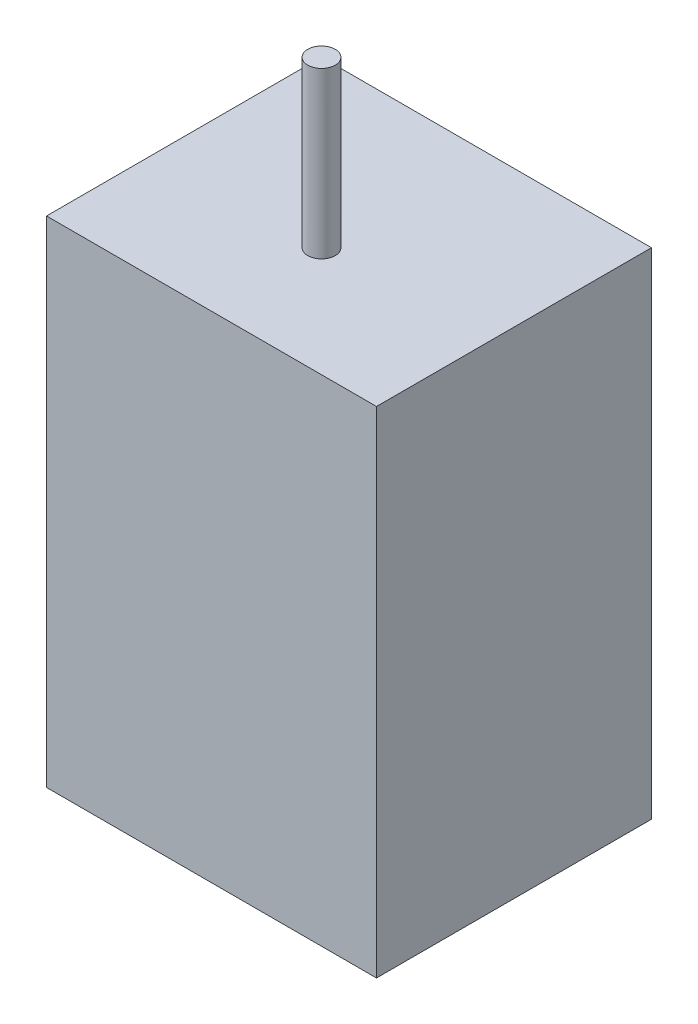
ISO-10303-21;
HEADER;
FILE_DESCRIPTION(('STEP AP214'),'2;1');
FILE_NAME('part.step','',(''),(''),'','','');
FILE_SCHEMA(('AUTOMOTIVE_DESIGN { 1 0 10303 214 1 1 1 1 }'));
ENDSEC;
DATA;
#1=APPLICATION_CONTEXT('core data for automotive mechanical design processes');
#2=APPLICATION_PROTOCOL_DEFINITION('international standard','automotive_design',2000,#1);
#3=PRODUCT_CONTEXT('',#1,'mechanical');
#4=PRODUCT('Part','Part','',(#3));
#5=PRODUCT_RELATED_PRODUCT_CATEGORY('part','',(#4));
#6=PRODUCT_DEFINITION_FORMATION('','',#4);
#7=PRODUCT_DEFINITION_CONTEXT('part definition',#1,'design');
#8=PRODUCT_DEFINITION('design','',#6,#7);
#9=PRODUCT_DEFINITION_SHAPE('','',#8);
#10=(LENGTH_UNIT() NAMED_UNIT(*) SI_UNIT(.MILLI.,.METRE.));
#11=(NAMED_UNIT(*) PLANE_ANGLE_UNIT() SI_UNIT($,.RADIAN.));
#12=(NAMED_UNIT(*) SI_UNIT($,.STERADIAN.) SOLID_ANGLE_UNIT());
#13=UNCERTAINTY_MEASURE_WITH_UNIT(LENGTH_MEASURE(1.E-05),#10,'distance_accuracy_value','');
#14=(GEOMETRIC_REPRESENTATION_CONTEXT(3) GLOBAL_UNCERTAINTY_ASSIGNED_CONTEXT((#13)) GLOBAL_UNIT_ASSIGNED_CONTEXT((#10,
#11,#12)) REPRESENTATION_CONTEXT('',''));
#15=CARTESIAN_POINT('',(0.,0.,0.));
#16=DIRECTION('',(0.,0.,1.));
#17=DIRECTION('',(1.,0.,0.));
#18=AXIS2_PLACEMENT_3D('',#15,#16,#17);
#19=CARTESIAN_POINT('',(0.,28.575,0.));
#20=DIRECTION('',(1.,0.,0.));
#21=DIRECTION('',(0.,0.,-1.));
#22=AXIS2_PLACEMENT_3D('',#19,#20,#21);
#23=PLANE('',#22);
#24=DIRECTION('',(0.,0.,1.));
#25=VECTOR('',#24,1.);
#26=CARTESIAN_POINT('',(0.,0.,0.));
#27=LINE('',#26,#25);
#28=CARTESIAN_POINT('',(0.,0.,-15.875));
#29=VERTEX_POINT('',#28);
#30=CARTESIAN_POINT('',(0.,0.,0.));
#31=VERTEX_POINT('',#30);
#32=EDGE_CURVE('E101',#29,#31,#27,.T.);
#33=ORIENTED_EDGE('',*,*,#32,.T.);
#34=DIRECTION('',(0.,-1.,0.));
#35=VECTOR('',#34,1.);
#36=CARTESIAN_POINT('',(0.,28.575,0.));
#37=LINE('',#36,#35);
#38=CARTESIAN_POINT('',(0.,28.575,0.));
#39=VERTEX_POINT('',#38);
#40=EDGE_CURVE('E43',#39,#31,#37,.T.);
#41=ORIENTED_EDGE('',*,*,#40,.F.);
#42=DIRECTION('',(0.,0.,1.));
#43=VECTOR('',#42,1.);
#44=CARTESIAN_POINT('',(0.,28.575,0.));
#45=LINE('',#44,#43);
#46=CARTESIAN_POINT('',(0.,28.575,-15.875));
#47=VERTEX_POINT('',#46);
#48=EDGE_CURVE('E87',#47,#39,#45,.T.);
#49=ORIENTED_EDGE('',*,*,#48,.F.);
#50=DIRECTION('',(0.,-1.,0.));
#51=VECTOR('',#50,1.);
#52=CARTESIAN_POINT('',(0.,28.575,-15.875));
#53=LINE('',#52,#51);
#54=EDGE_CURVE('E97',#47,#29,#53,.T.);
#55=ORIENTED_EDGE('',*,*,#54,.T.);
#56=EDGE_LOOP('',(#33,#41,#49,#55));
#57=FACE_BOUND('',#56,.T.);
#58=ADVANCED_FACE('F35',(#57),#23,.F.);
#59=CARTESIAN_POINT('',(0.,28.575,0.));
#60=DIRECTION('',(0.,0.,-1.));
#61=DIRECTION('',(-1.,0.,0.));
#62=AXIS2_PLACEMENT_3D('',#59,#60,#61);
#63=PLANE('',#62);
#64=DIRECTION('',(1.,0.,0.));
#65=VECTOR('',#64,1.);
#66=CARTESIAN_POINT('',(0.,0.,0.));
#67=LINE('',#66,#65);
#68=CARTESIAN_POINT('',(19.05,0.,0.));
#69=VERTEX_POINT('',#68);
#70=EDGE_CURVE('E92',#31,#69,#67,.T.);
#71=ORIENTED_EDGE('',*,*,#70,.T.);
#72=DIRECTION('',(0.,-1.,0.));
#73=VECTOR('',#72,1.);
#74=CARTESIAN_POINT('',(19.05,28.575,0.));
#75=LINE('',#74,#73);
#76=CARTESIAN_POINT('',(19.05,28.575,0.));
#77=VERTEX_POINT('',#76);
#78=EDGE_CURVE('E90',#77,#69,#75,.T.);
#79=ORIENTED_EDGE('',*,*,#78,.F.);
#80=DIRECTION('',(1.,0.,0.));
#81=VECTOR('',#80,1.);
#82=CARTESIAN_POINT('',(0.,28.575,0.));
#83=LINE('',#82,#81);
#84=EDGE_CURVE('E82',#39,#77,#83,.T.);
#85=ORIENTED_EDGE('',*,*,#84,.F.);
#86=ORIENTED_EDGE('',*,*,#40,.T.);
#87=EDGE_LOOP('',(#71,#79,#85,#86));
#88=FACE_BOUND('',#87,.T.);
#89=ADVANCED_FACE('F91',(#88),#63,.F.);
#90=CARTESIAN_POINT('',(19.05,28.575,0.));
#91=DIRECTION('',(-1.,0.,0.));
#92=DIRECTION('',(0.,0.,1.));
#93=AXIS2_PLACEMENT_3D('',#90,#91,#92);
#94=PLANE('',#93);
#95=DIRECTION('',(0.,0.,-1.));
#96=VECTOR('',#95,1.);
#97=CARTESIAN_POINT('',(19.05,0.,0.));
#98=LINE('',#97,#96);
#99=CARTESIAN_POINT('',(19.05,0.,-15.875));
#100=VERTEX_POINT('',#99);
#101=EDGE_CURVE('E68',#69,#100,#98,.T.);
#102=ORIENTED_EDGE('',*,*,#101,.T.);
#103=DIRECTION('',(0.,-1.,0.));
#104=VECTOR('',#103,1.);
#105=CARTESIAN_POINT('',(19.05,28.575,-15.875));
#106=LINE('',#105,#104);
#107=CARTESIAN_POINT('',(19.05,28.575,-15.875));
#108=VERTEX_POINT('',#107);
#109=EDGE_CURVE('E93',#108,#100,#106,.T.);
#110=ORIENTED_EDGE('',*,*,#109,.F.);
#111=DIRECTION('',(0.,0.,-1.));
#112=VECTOR('',#111,1.);
#113=CARTESIAN_POINT('',(19.05,28.575,0.));
#114=LINE('',#113,#112);
#115=EDGE_CURVE('E85',#77,#108,#114,.T.);
#116=ORIENTED_EDGE('',*,*,#115,.F.);
#117=ORIENTED_EDGE('',*,*,#78,.T.);
#118=EDGE_LOOP('',(#102,#110,#116,#117));
#119=FACE_BOUND('',#118,.T.);
#120=ADVANCED_FACE('F95',(#119),#94,.F.);
#121=CARTESIAN_POINT('',(0.,28.575,-15.875));
#122=DIRECTION('',(0.,0.,1.));
#123=DIRECTION('',(1.,0.,0.));
#124=AXIS2_PLACEMENT_3D('',#121,#122,#123);
#125=PLANE('',#124);
#126=DIRECTION('',(-1.,0.,0.));
#127=VECTOR('',#126,1.);
#128=CARTESIAN_POINT('',(0.,0.,-15.875));
#129=LINE('',#128,#127);
#130=EDGE_CURVE('E74',#100,#29,#129,.T.);
#131=ORIENTED_EDGE('',*,*,#130,.T.);
#132=ORIENTED_EDGE('',*,*,#54,.F.);
#133=DIRECTION('',(-1.,0.,0.));
#134=VECTOR('',#133,1.);
#135=CARTESIAN_POINT('',(0.,28.575,-15.875));
#136=LINE('',#135,#134);
#137=EDGE_CURVE('E51',#108,#47,#136,.T.);
#138=ORIENTED_EDGE('',*,*,#137,.F.);
#139=ORIENTED_EDGE('',*,*,#109,.T.);
#140=EDGE_LOOP('',(#131,#132,#138,#139));
#141=FACE_BOUND('',#140,.T.);
#142=ADVANCED_FACE('F123',(#141),#125,.F.);
#143=CARTESIAN_POINT('',(0.,28.575,0.));
#144=DIRECTION('',(0.,-1.,0.));
#145=DIRECTION('',(0.,0.,-1.));
#146=AXIS2_PLACEMENT_3D('',#143,#144,#145);
#147=PLANE('',#146);
#148=CARTESIAN_POINT('',(9.525,28.575,-6.35));
#149=DIRECTION('',(0.,-1.,0.));
#150=DIRECTION('',(0.,0.,-1.));
#151=AXIS2_PLACEMENT_3D('',#148,#149,#150);
#152=CIRCLE('',#151,0.79375);
#153=CARTESIAN_POINT('',(9.525,28.575,-7.14375));
#154=VERTEX_POINT('',#153);
#155=EDGE_CURVE('E11',#154,#154,#152,.F.);
#156=ORIENTED_EDGE('',*,*,#155,.F.);
#157=EDGE_LOOP('',(#156));
#158=FACE_BOUND('',#157,.T.);
#159=ORIENTED_EDGE('',*,*,#48,.T.);
#160=ORIENTED_EDGE('',*,*,#84,.T.);
#161=ORIENTED_EDGE('',*,*,#115,.T.);
#162=ORIENTED_EDGE('',*,*,#137,.T.);
#163=EDGE_LOOP('',(#159,#160,#161,#162));
#164=FACE_BOUND('',#163,.T.);
#165=ADVANCED_FACE('F83',(#158,#164),#147,.F.);
#166=CARTESIAN_POINT('',(0.,0.,0.));
#167=DIRECTION('',(0.,-1.,0.));
#168=DIRECTION('',(0.,0.,-1.));
#169=AXIS2_PLACEMENT_3D('',#166,#167,#168);
#170=PLANE('',#169);
#171=ORIENTED_EDGE('',*,*,#32,.F.);
#172=ORIENTED_EDGE('',*,*,#130,.F.);
#173=ORIENTED_EDGE('',*,*,#101,.F.);
#174=ORIENTED_EDGE('',*,*,#70,.F.);
#175=EDGE_LOOP('',(#171,#172,#173,#174));
#176=FACE_BOUND('',#175,.T.);
#177=ADVANCED_FACE('F112',(#176),#170,.T.);
#178=CARTESIAN_POINT('',(9.525,38.1,-6.35));
#179=DIRECTION('',(0.,-1.,0.));
#180=DIRECTION('',(0.,0.,-1.));
#181=AXIS2_PLACEMENT_3D('',#178,#179,#180);
#182=CYLINDRICAL_SURFACE('',#181,0.79375);
#183=CARTESIAN_POINT('',(9.525,38.1,-6.35));
#184=DIRECTION('',(0.,1.,0.));
#185=DIRECTION('',(0.,0.,1.));
#186=AXIS2_PLACEMENT_3D('',#183,#184,#185);
#187=CIRCLE('',#186,0.79375);
#188=CARTESIAN_POINT('',(9.525,38.1,-5.55625));
#189=VERTEX_POINT('',#188);
#190=EDGE_CURVE('E104',#189,#189,#187,.T.);
#191=ORIENTED_EDGE('',*,*,#190,.F.);
#192=EDGE_LOOP('',(#191));
#193=FACE_BOUND('',#192,.T.);
#194=ORIENTED_EDGE('',*,*,#155,.T.);
#195=EDGE_LOOP('',(#194));
#196=FACE_BOUND('',#195,.T.);
#197=ADVANCED_FACE('F114',(#193,#196),#182,.T.);
#198=CARTESIAN_POINT('',(0.,38.1,0.));
#199=DIRECTION('',(0.,1.,0.));
#200=DIRECTION('',(0.,0.,1.));
#201=AXIS2_PLACEMENT_3D('',#198,#199,#200);
#202=PLANE('',#201);
#203=ORIENTED_EDGE('',*,*,#190,.T.);
#204=EDGE_LOOP('',(#203));
#205=FACE_BOUND('',#204,.T.);
#206=ADVANCED_FACE('F120',(#205),#202,.T.);
#207=CLOSED_SHELL('',(#58,#89,#120,#142,#165,#177,#197,#206));
#208=MANIFOLD_SOLID_BREP('B2',#207);
#209=ADVANCED_BREP_SHAPE_REPRESENTATION('',(#18,#208),#14);
#210=SHAPE_DEFINITION_REPRESENTATION(#9,#209);
ENDSEC;
END-ISO-10303-21;
